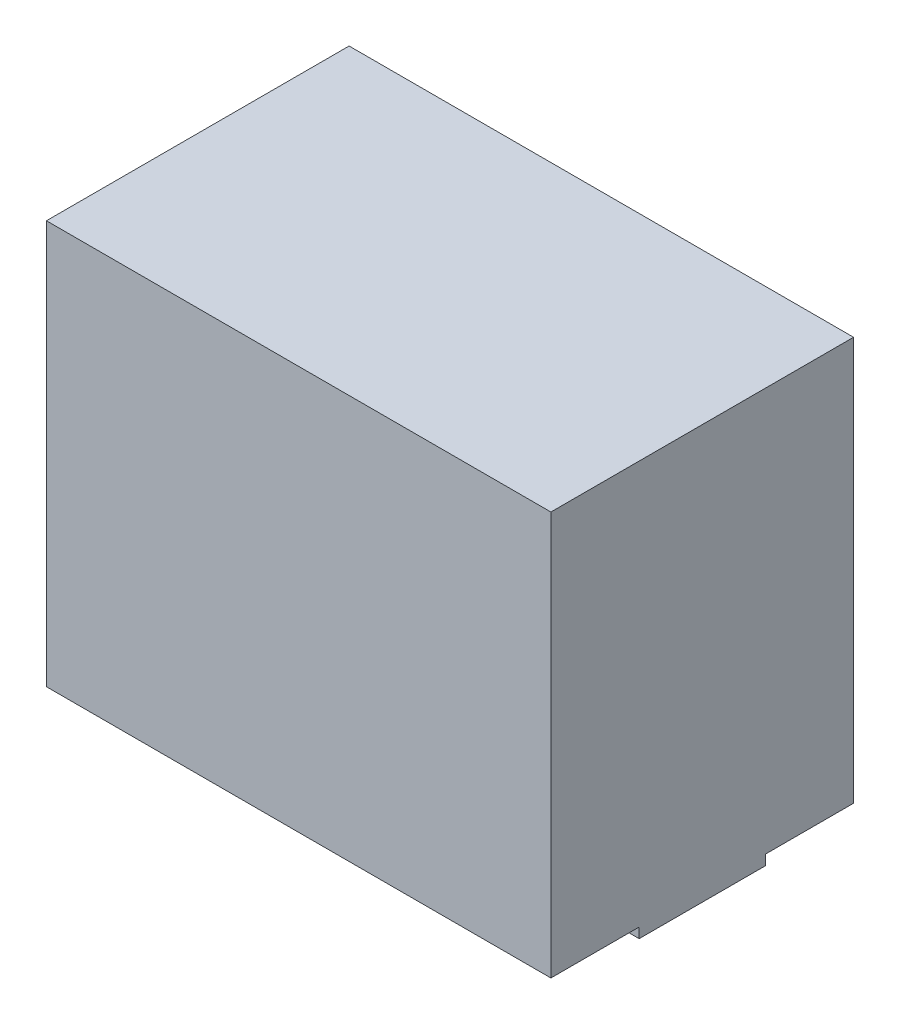
ISO-10303-21;
HEADER;
FILE_DESCRIPTION(('STEP AP214'),'2;1');
FILE_NAME('part.step','',(''),(''),'','','');
FILE_SCHEMA(('AUTOMOTIVE_DESIGN { 1 0 10303 214 1 1 1 1 }'));
ENDSEC;
DATA;
#1=APPLICATION_CONTEXT('core data for automotive mechanical design processes');
#2=APPLICATION_PROTOCOL_DEFINITION('international standard','automotive_design',2000,#1);
#3=PRODUCT_CONTEXT('',#1,'mechanical');
#4=PRODUCT('Part','Part','',(#3));
#5=PRODUCT_RELATED_PRODUCT_CATEGORY('part','',(#4));
#6=PRODUCT_DEFINITION_FORMATION('','',#4);
#7=PRODUCT_DEFINITION_CONTEXT('part definition',#1,'design');
#8=PRODUCT_DEFINITION('design','',#6,#7);
#9=PRODUCT_DEFINITION_SHAPE('','',#8);
#10=(LENGTH_UNIT() NAMED_UNIT(*) SI_UNIT(.MILLI.,.METRE.));
#11=(NAMED_UNIT(*) PLANE_ANGLE_UNIT() SI_UNIT($,.RADIAN.));
#12=(NAMED_UNIT(*) SI_UNIT($,.STERADIAN.) SOLID_ANGLE_UNIT());
#13=UNCERTAINTY_MEASURE_WITH_UNIT(LENGTH_MEASURE(1.E-05),#10,'distance_accuracy_value','');
#14=(GEOMETRIC_REPRESENTATION_CONTEXT(3) GLOBAL_UNCERTAINTY_ASSIGNED_CONTEXT((#13)) GLOBAL_UNIT_ASSIGNED_CONTEXT((#10,
#11,#12)) REPRESENTATION_CONTEXT('',''));
#15=CARTESIAN_POINT('',(0.,0.,0.));
#16=DIRECTION('',(0.,0.,1.));
#17=DIRECTION('',(1.,0.,0.));
#18=AXIS2_PLACEMENT_3D('',#15,#16,#17);
#19=CARTESIAN_POINT('',(0.,0.,0.));
#20=DIRECTION('',(0.,1.,0.));
#21=DIRECTION('',(0.,0.,1.));
#22=AXIS2_PLACEMENT_3D('',#19,#20,#21);
#23=PLANE('',#22);
#24=DIRECTION('',(-1.,0.,0.));
#25=VECTOR('',#24,1.);
#26=CARTESIAN_POINT('',(1.,0.,-0.175));
#27=LINE('',#26,#25);
#28=CARTESIAN_POINT('',(1.,0.,-0.175));
#29=VERTEX_POINT('',#28);
#30=CARTESIAN_POINT('',(0.8,0.,-0.175));
#31=VERTEX_POINT('',#30);
#32=EDGE_CURVE('E146',#29,#31,#27,.T.);
#33=ORIENTED_EDGE('',*,*,#32,.F.);
#34=DIRECTION('',(0.,0.,-1.));
#35=VECTOR('',#34,1.);
#36=CARTESIAN_POINT('',(1.,0.,0.));
#37=LINE('',#36,#35);
#38=CARTESIAN_POINT('',(1.,0.,0.));
#39=VERTEX_POINT('',#38);
#40=EDGE_CURVE('E234',#39,#29,#37,.T.);
#41=ORIENTED_EDGE('',*,*,#40,.F.);
#42=DIRECTION('',(1.,0.,0.));
#43=VECTOR('',#42,1.);
#44=CARTESIAN_POINT('',(0.,0.,0.));
#45=LINE('',#44,#43);
#46=CARTESIAN_POINT('',(0.,0.,0.));
#47=VERTEX_POINT('',#46);
#48=EDGE_CURVE('E213',#47,#39,#45,.T.);
#49=ORIENTED_EDGE('',*,*,#48,.F.);
#50=DIRECTION('',(0.,0.,-1.));
#51=VECTOR('',#50,1.);
#52=CARTESIAN_POINT('',(0.,0.,0.));
#53=LINE('',#52,#51);
#54=CARTESIAN_POINT('',(0.,0.,-0.175));
#55=VERTEX_POINT('',#54);
#56=EDGE_CURVE('E219',#47,#55,#53,.T.);
#57=ORIENTED_EDGE('',*,*,#56,.T.);
#58=DIRECTION('',(-1.,0.,0.));
#59=VECTOR('',#58,1.);
#60=CARTESIAN_POINT('',(0.,0.,-0.175));
#61=LINE('',#60,#59);
#62=CARTESIAN_POINT('',(0.2,0.,-0.175));
#63=VERTEX_POINT('',#62);
#64=EDGE_CURVE('E67',#63,#55,#61,.T.);
#65=ORIENTED_EDGE('',*,*,#64,.F.);
#66=DIRECTION('',(0.,0.,1.));
#67=VECTOR('',#66,1.);
#68=CARTESIAN_POINT('',(0.2,0.,-0.175));
#69=LINE('',#68,#67);
#70=CARTESIAN_POINT('',(0.2,0.,-0.425));
#71=VERTEX_POINT('',#70);
#72=EDGE_CURVE('E193',#71,#63,#69,.T.);
#73=ORIENTED_EDGE('',*,*,#72,.F.);
#74=DIRECTION('',(1.,0.,0.));
#75=VECTOR('',#74,1.);
#76=CARTESIAN_POINT('',(0.,0.,-0.425));
#77=LINE('',#76,#75);
#78=CARTESIAN_POINT('',(0.,0.,-0.425));
#79=VERTEX_POINT('',#78);
#80=EDGE_CURVE('E168',#79,#71,#77,.T.);
#81=ORIENTED_EDGE('',*,*,#80,.F.);
#82=CARTESIAN_POINT('',(0.,0.,-0.6));
#83=VERTEX_POINT('',#82);
#84=EDGE_CURVE('E241',#79,#83,#53,.T.);
#85=ORIENTED_EDGE('',*,*,#84,.T.);
#86=DIRECTION('',(1.,0.,0.));
#87=VECTOR('',#86,1.);
#88=CARTESIAN_POINT('',(0.,0.,-0.6));
#89=LINE('',#88,#87);
#90=CARTESIAN_POINT('',(1.,0.,-0.6));
#91=VERTEX_POINT('',#90);
#92=EDGE_CURVE('E238',#83,#91,#89,.T.);
#93=ORIENTED_EDGE('',*,*,#92,.T.);
#94=CARTESIAN_POINT('',(1.,0.,-0.425));
#95=VERTEX_POINT('',#94);
#96=EDGE_CURVE('E156',#95,#91,#37,.T.);
#97=ORIENTED_EDGE('',*,*,#96,.F.);
#98=DIRECTION('',(1.,0.,0.));
#99=VECTOR('',#98,1.);
#100=CARTESIAN_POINT('',(1.,0.,-0.425));
#101=LINE('',#100,#99);
#102=CARTESIAN_POINT('',(0.8,0.,-0.425));
#103=VERTEX_POINT('',#102);
#104=EDGE_CURVE('E147',#103,#95,#101,.T.);
#105=ORIENTED_EDGE('',*,*,#104,.F.);
#106=DIRECTION('',(0.,0.,-1.));
#107=VECTOR('',#106,1.);
#108=CARTESIAN_POINT('',(0.8,0.,-0.175));
#109=LINE('',#108,#107);
#110=EDGE_CURVE('E135',#31,#103,#109,.T.);
#111=ORIENTED_EDGE('',*,*,#110,.F.);
#112=EDGE_LOOP('',(#33,#41,#49,#57,#65,#73,#81,#85,#93,#97,#105,#111));
#113=FACE_BOUND('',#112,.T.);
#114=ADVANCED_FACE('F43',(#113),#23,.F.);
#115=CARTESIAN_POINT('',(0.,0.8,0.));
#116=DIRECTION('',(0.,0.,-1.));
#117=DIRECTION('',(-1.,0.,0.));
#118=AXIS2_PLACEMENT_3D('',#115,#116,#117);
#119=PLANE('',#118);
#120=ORIENTED_EDGE('',*,*,#48,.T.);
#121=DIRECTION('',(0.,-1.,0.));
#122=VECTOR('',#121,1.);
#123=CARTESIAN_POINT('',(1.,0.8,0.));
#124=LINE('',#123,#122);
#125=CARTESIAN_POINT('',(1.,0.8,0.));
#126=VERTEX_POINT('',#125);
#127=EDGE_CURVE('E11',#126,#39,#124,.T.);
#128=ORIENTED_EDGE('',*,*,#127,.F.);
#129=DIRECTION('',(1.,0.,0.));
#130=VECTOR('',#129,1.);
#131=CARTESIAN_POINT('',(0.,0.8,0.));
#132=LINE('',#131,#130);
#133=CARTESIAN_POINT('',(0.,0.8,0.));
#134=VERTEX_POINT('',#133);
#135=EDGE_CURVE('E214',#134,#126,#132,.T.);
#136=ORIENTED_EDGE('',*,*,#135,.F.);
#137=DIRECTION('',(0.,-1.,0.));
#138=VECTOR('',#137,1.);
#139=CARTESIAN_POINT('',(0.,0.8,0.));
#140=LINE('',#139,#138);
#141=EDGE_CURVE('E230',#134,#47,#140,.T.);
#142=ORIENTED_EDGE('',*,*,#141,.T.);
#143=EDGE_LOOP('',(#120,#128,#136,#142));
#144=FACE_BOUND('',#143,.T.);
#145=ADVANCED_FACE('F45',(#144),#119,.F.);
#146=CARTESIAN_POINT('',(1.,0.8,0.));
#147=DIRECTION('',(-1.,0.,0.));
#148=DIRECTION('',(0.,0.,1.));
#149=AXIS2_PLACEMENT_3D('',#146,#147,#148);
#150=PLANE('',#149);
#151=ORIENTED_EDGE('',*,*,#40,.T.);
#152=DIRECTION('',(0.,1.,0.));
#153=VECTOR('',#152,1.);
#154=CARTESIAN_POINT('',(1.,-0.02,-0.175));
#155=LINE('',#154,#153);
#156=CARTESIAN_POINT('',(1.,-0.02,-0.175));
#157=VERTEX_POINT('',#156);
#158=EDGE_CURVE('E433',#157,#29,#155,.T.);
#159=ORIENTED_EDGE('',*,*,#158,.F.);
#160=DIRECTION('',(0.,0.,1.));
#161=VECTOR('',#160,1.);
#162=CARTESIAN_POINT('',(1.,-0.02,-0.175));
#163=LINE('',#162,#161);
#164=CARTESIAN_POINT('',(1.,-0.02,-0.425));
#165=VERTEX_POINT('',#164);
#166=EDGE_CURVE('E158',#165,#157,#163,.T.);
#167=ORIENTED_EDGE('',*,*,#166,.F.);
#168=DIRECTION('',(0.,1.,0.));
#169=VECTOR('',#168,1.);
#170=CARTESIAN_POINT('',(1.,-0.02,-0.425));
#171=LINE('',#170,#169);
#172=EDGE_CURVE('E59',#165,#95,#171,.T.);
#173=ORIENTED_EDGE('',*,*,#172,.T.);
#174=ORIENTED_EDGE('',*,*,#96,.T.);
#175=DIRECTION('',(0.,-1.,0.));
#176=VECTOR('',#175,1.);
#177=CARTESIAN_POINT('',(1.,0.8,-0.6));
#178=LINE('',#177,#176);
#179=CARTESIAN_POINT('',(1.,0.8,-0.6));
#180=VERTEX_POINT('',#179);
#181=EDGE_CURVE('E52',#180,#91,#178,.T.);
#182=ORIENTED_EDGE('',*,*,#181,.F.);
#183=DIRECTION('',(0.,0.,-1.));
#184=VECTOR('',#183,1.);
#185=CARTESIAN_POINT('',(1.,0.8,0.));
#186=LINE('',#185,#184);
#187=EDGE_CURVE('E218',#126,#180,#186,.T.);
#188=ORIENTED_EDGE('',*,*,#187,.F.);
#189=ORIENTED_EDGE('',*,*,#127,.T.);
#190=EDGE_LOOP('',(#151,#159,#167,#173,#174,#182,#188,#189));
#191=FACE_BOUND('',#190,.T.);
#192=ADVANCED_FACE('F267',(#191),#150,.F.);
#193=CARTESIAN_POINT('',(0.,0.8,-0.6));
#194=DIRECTION('',(0.,0.,-1.));
#195=DIRECTION('',(-1.,0.,0.));
#196=AXIS2_PLACEMENT_3D('',#193,#194,#195);
#197=PLANE('',#196);
#198=ORIENTED_EDGE('',*,*,#92,.F.);
#199=DIRECTION('',(0.,-1.,0.));
#200=VECTOR('',#199,1.);
#201=CARTESIAN_POINT('',(0.,0.8,-0.6));
#202=LINE('',#201,#200);
#203=CARTESIAN_POINT('',(0.,0.8,-0.6));
#204=VERTEX_POINT('',#203);
#205=EDGE_CURVE('E246',#204,#83,#202,.T.);
#206=ORIENTED_EDGE('',*,*,#205,.F.);
#207=DIRECTION('',(1.,0.,0.));
#208=VECTOR('',#207,1.);
#209=CARTESIAN_POINT('',(0.,0.8,-0.6));
#210=LINE('',#209,#208);
#211=EDGE_CURVE('E222',#204,#180,#210,.T.);
#212=ORIENTED_EDGE('',*,*,#211,.T.);
#213=ORIENTED_EDGE('',*,*,#181,.T.);
#214=EDGE_LOOP('',(#198,#206,#212,#213));
#215=FACE_BOUND('',#214,.T.);
#216=ADVANCED_FACE('F254',(#215),#197,.T.);
#217=CARTESIAN_POINT('',(0.,0.8,0.));
#218=DIRECTION('',(-1.,0.,0.));
#219=DIRECTION('',(0.,0.,1.));
#220=AXIS2_PLACEMENT_3D('',#217,#218,#219);
#221=PLANE('',#220);
#222=ORIENTED_EDGE('',*,*,#56,.F.);
#223=ORIENTED_EDGE('',*,*,#141,.F.);
#224=DIRECTION('',(0.,0.,-1.));
#225=VECTOR('',#224,1.);
#226=CARTESIAN_POINT('',(0.,0.8,0.));
#227=LINE('',#226,#225);
#228=EDGE_CURVE('E226',#134,#204,#227,.T.);
#229=ORIENTED_EDGE('',*,*,#228,.T.);
#230=ORIENTED_EDGE('',*,*,#205,.T.);
#231=ORIENTED_EDGE('',*,*,#84,.F.);
#232=DIRECTION('',(0.,1.,0.));
#233=VECTOR('',#232,1.);
#234=CARTESIAN_POINT('',(0.,-0.02,-0.425));
#235=LINE('',#234,#233);
#236=CARTESIAN_POINT('',(0.,-0.02,-0.425));
#237=VERTEX_POINT('',#236);
#238=EDGE_CURVE('E209',#237,#79,#235,.T.);
#239=ORIENTED_EDGE('',*,*,#238,.F.);
#240=DIRECTION('',(0.,0.,-1.));
#241=VECTOR('',#240,1.);
#242=CARTESIAN_POINT('',(0.,-0.02,-0.175));
#243=LINE('',#242,#241);
#244=CARTESIAN_POINT('',(0.,-0.02,-0.175));
#245=VERTEX_POINT('',#244);
#246=EDGE_CURVE('E176',#245,#237,#243,.T.);
#247=ORIENTED_EDGE('',*,*,#246,.F.);
#248=DIRECTION('',(0.,1.,0.));
#249=VECTOR('',#248,1.);
#250=CARTESIAN_POINT('',(0.,-0.02,-0.175));
#251=LINE('',#250,#249);
#252=EDGE_CURVE('E189',#245,#55,#251,.T.);
#253=ORIENTED_EDGE('',*,*,#252,.T.);
#254=EDGE_LOOP('',(#222,#223,#229,#230,#231,#239,#247,#253));
#255=FACE_BOUND('',#254,.T.);
#256=ADVANCED_FACE('F261',(#255),#221,.T.);
#257=CARTESIAN_POINT('',(0.,0.8,0.));
#258=DIRECTION('',(0.,1.,0.));
#259=DIRECTION('',(0.,0.,1.));
#260=AXIS2_PLACEMENT_3D('',#257,#258,#259);
#261=PLANE('',#260);
#262=ORIENTED_EDGE('',*,*,#135,.T.);
#263=ORIENTED_EDGE('',*,*,#187,.T.);
#264=ORIENTED_EDGE('',*,*,#211,.F.);
#265=ORIENTED_EDGE('',*,*,#228,.F.);
#266=EDGE_LOOP('',(#262,#263,#264,#265));
#267=FACE_BOUND('',#266,.T.);
#268=ADVANCED_FACE('F264',(#267),#261,.T.);
#269=CARTESIAN_POINT('',(0.,-0.02,-0.425));
#270=DIRECTION('',(0.,0.,1.));
#271=DIRECTION('',(1.,0.,0.));
#272=AXIS2_PLACEMENT_3D('',#269,#270,#271);
#273=PLANE('',#272);
#274=ORIENTED_EDGE('',*,*,#80,.T.);
#275=DIRECTION('',(0.,1.,0.));
#276=VECTOR('',#275,1.);
#277=CARTESIAN_POINT('',(0.2,-0.02,-0.425));
#278=LINE('',#277,#276);
#279=CARTESIAN_POINT('',(0.2,-0.02,-0.425));
#280=VERTEX_POINT('',#279);
#281=EDGE_CURVE('E205',#280,#71,#278,.T.);
#282=ORIENTED_EDGE('',*,*,#281,.F.);
#283=DIRECTION('',(1.,0.,0.));
#284=VECTOR('',#283,1.);
#285=CARTESIAN_POINT('',(0.,-0.02,-0.425));
#286=LINE('',#285,#284);
#287=EDGE_CURVE('E180',#237,#280,#286,.T.);
#288=ORIENTED_EDGE('',*,*,#287,.F.);
#289=ORIENTED_EDGE('',*,*,#238,.T.);
#290=EDGE_LOOP('',(#274,#282,#288,#289));
#291=FACE_BOUND('',#290,.T.);
#292=ADVANCED_FACE('F282',(#291),#273,.F.);
#293=CARTESIAN_POINT('',(0.2,-0.02,-0.175));
#294=DIRECTION('',(-1.,0.,0.));
#295=DIRECTION('',(0.,0.,1.));
#296=AXIS2_PLACEMENT_3D('',#293,#294,#295);
#297=PLANE('',#296);
#298=ORIENTED_EDGE('',*,*,#72,.T.);
#299=DIRECTION('',(0.,1.,0.));
#300=VECTOR('',#299,1.);
#301=CARTESIAN_POINT('',(0.2,-0.02,-0.175));
#302=LINE('',#301,#300);
#303=CARTESIAN_POINT('',(0.2,-0.02,-0.175));
#304=VERTEX_POINT('',#303);
#305=EDGE_CURVE('E201',#304,#63,#302,.T.);
#306=ORIENTED_EDGE('',*,*,#305,.F.);
#307=DIRECTION('',(0.,0.,1.));
#308=VECTOR('',#307,1.);
#309=CARTESIAN_POINT('',(0.2,-0.02,-0.175));
#310=LINE('',#309,#308);
#311=EDGE_CURVE('E183',#280,#304,#310,.T.);
#312=ORIENTED_EDGE('',*,*,#311,.F.);
#313=ORIENTED_EDGE('',*,*,#281,.T.);
#314=EDGE_LOOP('',(#298,#306,#312,#313));
#315=FACE_BOUND('',#314,.T.);
#316=ADVANCED_FACE('F279',(#315),#297,.F.);
#317=CARTESIAN_POINT('',(0.,-0.02,-0.175));
#318=DIRECTION('',(0.,0.,-1.));
#319=DIRECTION('',(-1.,0.,0.));
#320=AXIS2_PLACEMENT_3D('',#317,#318,#319);
#321=PLANE('',#320);
#322=ORIENTED_EDGE('',*,*,#64,.T.);
#323=ORIENTED_EDGE('',*,*,#252,.F.);
#324=DIRECTION('',(-1.,0.,0.));
#325=VECTOR('',#324,1.);
#326=CARTESIAN_POINT('',(0.,-0.02,-0.175));
#327=LINE('',#326,#325);
#328=EDGE_CURVE('E186',#304,#245,#327,.T.);
#329=ORIENTED_EDGE('',*,*,#328,.F.);
#330=ORIENTED_EDGE('',*,*,#305,.T.);
#331=EDGE_LOOP('',(#322,#323,#329,#330));
#332=FACE_BOUND('',#331,.T.);
#333=ADVANCED_FACE('F275',(#332),#321,.F.);
#334=CARTESIAN_POINT('',(0.,-0.02,0.));
#335=DIRECTION('',(0.,-1.,0.));
#336=DIRECTION('',(0.,0.,-1.));
#337=AXIS2_PLACEMENT_3D('',#334,#335,#336);
#338=PLANE('',#337);
#339=ORIENTED_EDGE('',*,*,#246,.T.);
#340=ORIENTED_EDGE('',*,*,#287,.T.);
#341=ORIENTED_EDGE('',*,*,#311,.T.);
#342=ORIENTED_EDGE('',*,*,#328,.T.);
#343=EDGE_LOOP('',(#339,#340,#341,#342));
#344=FACE_BOUND('',#343,.T.);
#345=ADVANCED_FACE('F284',(#344),#338,.T.);
#346=CARTESIAN_POINT('',(1.,-0.02,-0.175));
#347=DIRECTION('',(0.,0.,-1.));
#348=DIRECTION('',(-1.,0.,0.));
#349=AXIS2_PLACEMENT_3D('',#346,#347,#348);
#350=PLANE('',#349);
#351=ORIENTED_EDGE('',*,*,#32,.T.);
#352=DIRECTION('',(0.,1.,0.));
#353=VECTOR('',#352,1.);
#354=CARTESIAN_POINT('',(0.8,-0.02,-0.175));
#355=LINE('',#354,#353);
#356=CARTESIAN_POINT('',(0.8,-0.02,-0.175));
#357=VERTEX_POINT('',#356);
#358=EDGE_CURVE('E142',#357,#31,#355,.T.);
#359=ORIENTED_EDGE('',*,*,#358,.F.);
#360=DIRECTION('',(-1.,0.,0.));
#361=VECTOR('',#360,1.);
#362=CARTESIAN_POINT('',(1.,-0.02,-0.175));
#363=LINE('',#362,#361);
#364=EDGE_CURVE('E162',#157,#357,#363,.T.);
#365=ORIENTED_EDGE('',*,*,#364,.F.);
#366=ORIENTED_EDGE('',*,*,#158,.T.);
#367=EDGE_LOOP('',(#351,#359,#365,#366));
#368=FACE_BOUND('',#367,.T.);
#369=ADVANCED_FACE('F286',(#368),#350,.F.);
#370=CARTESIAN_POINT('',(0.8,-0.02,-0.175));
#371=DIRECTION('',(1.,0.,0.));
#372=DIRECTION('',(0.,0.,-1.));
#373=AXIS2_PLACEMENT_3D('',#370,#371,#372);
#374=PLANE('',#373);
#375=ORIENTED_EDGE('',*,*,#110,.T.);
#376=DIRECTION('',(0.,1.,0.));
#377=VECTOR('',#376,1.);
#378=CARTESIAN_POINT('',(0.8,-0.02,-0.425));
#379=LINE('',#378,#377);
#380=CARTESIAN_POINT('',(0.8,-0.02,-0.425));
#381=VERTEX_POINT('',#380);
#382=EDGE_CURVE('E139',#381,#103,#379,.T.);
#383=ORIENTED_EDGE('',*,*,#382,.F.);
#384=DIRECTION('',(0.,0.,-1.));
#385=VECTOR('',#384,1.);
#386=CARTESIAN_POINT('',(0.8,-0.02,-0.175));
#387=LINE('',#386,#385);
#388=EDGE_CURVE('E171',#357,#381,#387,.T.);
#389=ORIENTED_EDGE('',*,*,#388,.F.);
#390=ORIENTED_EDGE('',*,*,#358,.T.);
#391=EDGE_LOOP('',(#375,#383,#389,#390));
#392=FACE_BOUND('',#391,.T.);
#393=ADVANCED_FACE('F137',(#392),#374,.F.);
#394=CARTESIAN_POINT('',(1.,-0.02,-0.425));
#395=DIRECTION('',(0.,0.,1.));
#396=DIRECTION('',(1.,0.,0.));
#397=AXIS2_PLACEMENT_3D('',#394,#395,#396);
#398=PLANE('',#397);
#399=ORIENTED_EDGE('',*,*,#104,.T.);
#400=ORIENTED_EDGE('',*,*,#172,.F.);
#401=DIRECTION('',(1.,0.,0.));
#402=VECTOR('',#401,1.);
#403=CARTESIAN_POINT('',(1.,-0.02,-0.425));
#404=LINE('',#403,#402);
#405=EDGE_CURVE('E152',#381,#165,#404,.T.);
#406=ORIENTED_EDGE('',*,*,#405,.F.);
#407=ORIENTED_EDGE('',*,*,#382,.T.);
#408=EDGE_LOOP('',(#399,#400,#406,#407));
#409=FACE_BOUND('',#408,.T.);
#410=ADVANCED_FACE('F150',(#409),#398,.F.);
#411=CARTESIAN_POINT('',(0.,-0.02,0.));
#412=DIRECTION('',(0.,1.,0.));
#413=DIRECTION('',(0.,0.,1.));
#414=AXIS2_PLACEMENT_3D('',#411,#412,#413);
#415=PLANE('',#414);
#416=ORIENTED_EDGE('',*,*,#166,.T.);
#417=ORIENTED_EDGE('',*,*,#364,.T.);
#418=ORIENTED_EDGE('',*,*,#388,.T.);
#419=ORIENTED_EDGE('',*,*,#405,.T.);
#420=EDGE_LOOP('',(#416,#417,#418,#419));
#421=FACE_BOUND('',#420,.T.);
#422=ADVANCED_FACE('F371',(#421),#415,.F.);
#423=CLOSED_SHELL('',(#114,#145,#192,#216,#256,#268,#292,#316,#333,#345,#369,#393,#410,#422));
#424=MANIFOLD_SOLID_BREP('B2',#423);
#425=ADVANCED_BREP_SHAPE_REPRESENTATION('',(#18,#424),#14);
#426=SHAPE_DEFINITION_REPRESENTATION(#9,#425);
ENDSEC;
END-ISO-10303-21;
